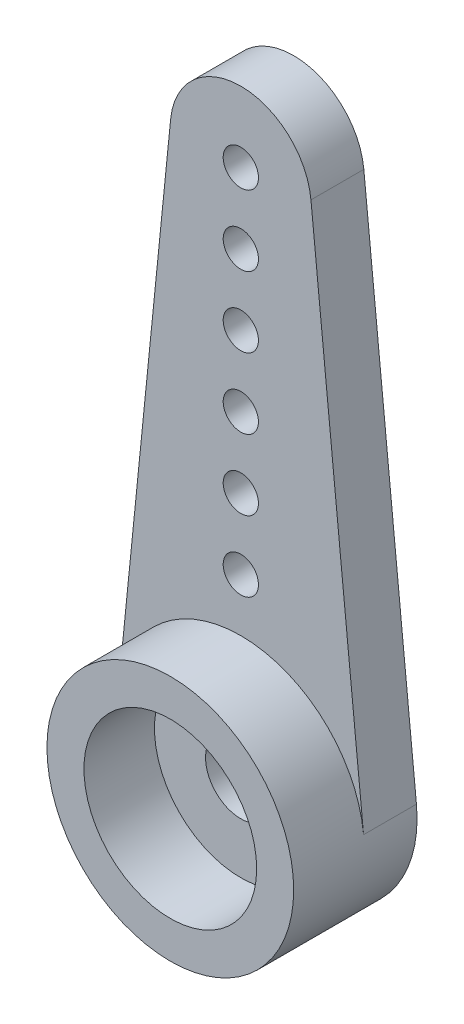
ISO-10303-21;
HEADER;
FILE_DESCRIPTION(('STEP AP214'),'2;1');
FILE_NAME('part.step','',(''),(''),'','','');
FILE_SCHEMA(('AUTOMOTIVE_DESIGN { 1 0 10303 214 1 1 1 1 }'));
ENDSEC;
DATA;
#1=APPLICATION_CONTEXT('core data for automotive mechanical design processes');
#2=APPLICATION_PROTOCOL_DEFINITION('international standard','automotive_design',2000,#1);
#3=PRODUCT_CONTEXT('',#1,'mechanical');
#4=PRODUCT('Part','Part','',(#3));
#5=PRODUCT_RELATED_PRODUCT_CATEGORY('part','',(#4));
#6=PRODUCT_DEFINITION_FORMATION('','',#4);
#7=PRODUCT_DEFINITION_CONTEXT('part definition',#1,'design');
#8=PRODUCT_DEFINITION('design','',#6,#7);
#9=PRODUCT_DEFINITION_SHAPE('','',#8);
#10=(LENGTH_UNIT() NAMED_UNIT(*) SI_UNIT(.MILLI.,.METRE.));
#11=(NAMED_UNIT(*) PLANE_ANGLE_UNIT() SI_UNIT($,.RADIAN.));
#12=(NAMED_UNIT(*) SI_UNIT($,.STERADIAN.) SOLID_ANGLE_UNIT());
#13=UNCERTAINTY_MEASURE_WITH_UNIT(LENGTH_MEASURE(1.E-05),#10,'distance_accuracy_value','');
#14=(GEOMETRIC_REPRESENTATION_CONTEXT(3) GLOBAL_UNCERTAINTY_ASSIGNED_CONTEXT((#13)) GLOBAL_UNIT_ASSIGNED_CONTEXT((#10,
#11,#12)) REPRESENTATION_CONTEXT('',''));
#15=CARTESIAN_POINT('',(0.,0.,0.));
#16=DIRECTION('',(0.,0.,1.));
#17=DIRECTION('',(1.,0.,0.));
#18=AXIS2_PLACEMENT_3D('',#15,#16,#17);
#19=CARTESIAN_POINT('',(0.,0.,1.5));
#20=DIRECTION('',(0.,0.,-1.));
#21=DIRECTION('',(-1.,0.,0.));
#22=AXIS2_PLACEMENT_3D('',#19,#20,#21);
#23=CYLINDRICAL_SURFACE('',#22,1.);
#24=CARTESIAN_POINT('',(0.,0.,0.));
#25=DIRECTION('',(0.,0.,1.));
#26=DIRECTION('',(1.,0.,0.));
#27=AXIS2_PLACEMENT_3D('',#24,#25,#26);
#28=CIRCLE('',#27,1.);
#29=CARTESIAN_POINT('',(1.,0.,0.));
#30=VERTEX_POINT('',#29);
#31=EDGE_CURVE('E135',#30,#30,#28,.T.);
#32=ORIENTED_EDGE('',*,*,#31,.F.);
#33=EDGE_LOOP('',(#32));
#34=FACE_BOUND('',#33,.T.);
#35=CARTESIAN_POINT('',(0.,0.,1.5));
#36=DIRECTION('',(0.,0.,1.));
#37=DIRECTION('',(1.,0.,0.));
#38=AXIS2_PLACEMENT_3D('',#35,#36,#37);
#39=CIRCLE('',#38,1.);
#40=CARTESIAN_POINT('',(1.,0.,1.5));
#41=VERTEX_POINT('',#40);
#42=EDGE_CURVE('E36',#41,#41,#39,.T.);
#43=ORIENTED_EDGE('',*,*,#42,.T.);
#44=EDGE_LOOP('',(#43));
#45=FACE_BOUND('',#44,.T.);
#46=ADVANCED_FACE('F32',(#34,#45),#23,.F.);
#47=CARTESIAN_POINT('',(0.,15.,1.5));
#48=DIRECTION('',(0.,0.,1.));
#49=DIRECTION('',(1.,0.,0.));
#50=AXIS2_PLACEMENT_3D('',#47,#48,#49);
#51=PLANE('',#50);
#52=CARTESIAN_POINT('',(0.,0.,1.5));
#53=DIRECTION('',(0.,0.,1.));
#54=DIRECTION('',(1.,0.,0.));
#55=AXIS2_PLACEMENT_3D('',#52,#53,#54);
#56=CIRCLE('',#55,3.5);
#57=CARTESIAN_POINT('',(3.48245602987317,0.35,1.5));
#58=VERTEX_POINT('',#57);
#59=CARTESIAN_POINT('',(-3.48245602987317,0.35,1.5));
#60=VERTEX_POINT('',#59);
#61=EDGE_CURVE('E89',#58,#60,#56,.T.);
#62=ORIENTED_EDGE('',*,*,#61,.F.);
#63=DIRECTION('',(-0.1,0.99498743710662,0.));
#64=VECTOR('',#63,1.);
#65=CARTESIAN_POINT('',(1.98997487421324,15.2,1.5));
#66=LINE('',#65,#64);
#67=CARTESIAN_POINT('',(1.98997487421324,15.2,1.5));
#68=VERTEX_POINT('',#67);
#69=EDGE_CURVE('E50',#58,#68,#66,.T.);
#70=ORIENTED_EDGE('',*,*,#69,.T.);
#71=CARTESIAN_POINT('',(0.,15.,1.5));
#72=DIRECTION('',(0.,0.,1.));
#73=DIRECTION('',(1.,0.,0.));
#74=AXIS2_PLACEMENT_3D('',#71,#72,#73);
#75=CIRCLE('',#74,2.);
#76=CARTESIAN_POINT('',(-1.98997487421324,15.2,1.5));
#77=VERTEX_POINT('',#76);
#78=EDGE_CURVE('E141',#68,#77,#75,.T.);
#79=ORIENTED_EDGE('',*,*,#78,.T.);
#80=DIRECTION('',(-0.1,-0.99498743710662,0.));
#81=VECTOR('',#80,1.);
#82=CARTESIAN_POINT('',(-1.98997487421324,15.2,1.5));
#83=LINE('',#82,#81);
#84=EDGE_CURVE('E79',#77,#60,#83,.T.);
#85=ORIENTED_EDGE('',*,*,#84,.T.);
#86=EDGE_LOOP('',(#62,#70,#79,#85));
#87=FACE_BOUND('',#86,.T.);
#88=CARTESIAN_POINT('',(0.,7.,1.5));
#89=DIRECTION('',(0.,0.,1.));
#90=DIRECTION('',(1.,0.,0.));
#91=AXIS2_PLACEMENT_3D('',#88,#89,#90);
#92=CIRCLE('',#91,0.5);
#93=CARTESIAN_POINT('',(0.500000000000084,7.,1.5));
#94=VERTEX_POINT('',#93);
#95=EDGE_CURVE('E108',#94,#94,#92,.T.);
#96=ORIENTED_EDGE('',*,*,#95,.F.);
#97=EDGE_LOOP('',(#96));
#98=FACE_BOUND('',#97,.T.);
#99=CARTESIAN_POINT('',(0.,11.,1.5));
#100=DIRECTION('',(0.,0.,1.));
#101=DIRECTION('',(1.,0.,0.));
#102=AXIS2_PLACEMENT_3D('',#99,#100,#101);
#103=CIRCLE('',#102,0.5);
#104=CARTESIAN_POINT('',(0.500000000000042,11.,1.5));
#105=VERTEX_POINT('',#104);
#106=EDGE_CURVE('E120',#105,#105,#103,.T.);
#107=ORIENTED_EDGE('',*,*,#106,.F.);
#108=EDGE_LOOP('',(#107));
#109=FACE_BOUND('',#108,.T.);
#110=CARTESIAN_POINT('',(0.,15.,1.5));
#111=DIRECTION('',(0.,0.,1.));
#112=DIRECTION('',(1.,0.,0.));
#113=AXIS2_PLACEMENT_3D('',#110,#111,#112);
#114=CIRCLE('',#113,0.5);
#115=CARTESIAN_POINT('',(0.5,15.,1.5));
#116=VERTEX_POINT('',#115);
#117=EDGE_CURVE('E132',#116,#116,#114,.T.);
#118=ORIENTED_EDGE('',*,*,#117,.F.);
#119=EDGE_LOOP('',(#118));
#120=FACE_BOUND('',#119,.T.);
#121=CARTESIAN_POINT('',(0.,13.,1.5));
#122=DIRECTION('',(0.,0.,1.));
#123=DIRECTION('',(1.,0.,0.));
#124=AXIS2_PLACEMENT_3D('',#121,#122,#123);
#125=CIRCLE('',#124,0.5);
#126=CARTESIAN_POINT('',(0.500000000000021,13.,1.5));
#127=VERTEX_POINT('',#126);
#128=EDGE_CURVE('E126',#127,#127,#125,.T.);
#129=ORIENTED_EDGE('',*,*,#128,.F.);
#130=EDGE_LOOP('',(#129));
#131=FACE_BOUND('',#130,.T.);
#132=CARTESIAN_POINT('',(0.,9.,1.5));
#133=DIRECTION('',(0.,0.,1.));
#134=DIRECTION('',(1.,0.,0.));
#135=AXIS2_PLACEMENT_3D('',#132,#133,#134);
#136=CIRCLE('',#135,0.5);
#137=CARTESIAN_POINT('',(0.500000000000063,9.,1.5));
#138=VERTEX_POINT('',#137);
#139=EDGE_CURVE('E114',#138,#138,#136,.T.);
#140=ORIENTED_EDGE('',*,*,#139,.F.);
#141=EDGE_LOOP('',(#140));
#142=FACE_BOUND('',#141,.T.);
#143=CARTESIAN_POINT('',(1.04744440165294E-13,5.,1.5));
#144=DIRECTION('',(0.,0.,1.));
#145=DIRECTION('',(1.,0.,0.));
#146=AXIS2_PLACEMENT_3D('',#143,#144,#145);
#147=CIRCLE('',#146,0.5);
#148=CARTESIAN_POINT('',(0.500000000000105,5.,1.5));
#149=VERTEX_POINT('',#148);
#150=EDGE_CURVE('E102',#149,#149,#147,.T.);
#151=ORIENTED_EDGE('',*,*,#150,.F.);
#152=EDGE_LOOP('',(#151));
#153=FACE_BOUND('',#152,.T.);
#154=ADVANCED_FACE('F91',(#87,#98,#109,#120,#131,#142,#153),#51,.T.);
#155=CARTESIAN_POINT('',(0.,15.,0.));
#156=DIRECTION('',(0.,0.,1.));
#157=DIRECTION('',(1.,0.,0.));
#158=AXIS2_PLACEMENT_3D('',#155,#156,#157);
#159=PLANE('',#158);
#160=CARTESIAN_POINT('',(0.,15.,0.));
#161=DIRECTION('',(0.,0.,1.));
#162=DIRECTION('',(1.,0.,0.));
#163=AXIS2_PLACEMENT_3D('',#160,#161,#162);
#164=CIRCLE('',#163,2.);
#165=CARTESIAN_POINT('',(1.98997487421324,15.2,0.));
#166=VERTEX_POINT('',#165);
#167=CARTESIAN_POINT('',(-1.98997487421324,15.2,0.));
#168=VERTEX_POINT('',#167);
#169=EDGE_CURVE('E140',#166,#168,#164,.T.);
#170=ORIENTED_EDGE('',*,*,#169,.F.);
#171=DIRECTION('',(-0.1,0.99498743710662,0.));
#172=VECTOR('',#171,1.);
#173=CARTESIAN_POINT('',(1.98997487421324,15.2,0.));
#174=LINE('',#173,#172);
#175=CARTESIAN_POINT('',(3.48245602987317,0.35,0.));
#176=VERTEX_POINT('',#175);
#177=EDGE_CURVE('E74',#176,#166,#174,.T.);
#178=ORIENTED_EDGE('',*,*,#177,.F.);
#179=CARTESIAN_POINT('',(0.,0.,0.));
#180=DIRECTION('',(0.,0.,1.));
#181=DIRECTION('',(1.,0.,0.));
#182=AXIS2_PLACEMENT_3D('',#179,#180,#181);
#183=CIRCLE('',#182,3.5);
#184=CARTESIAN_POINT('',(-3.48245602987317,0.35,0.));
#185=VERTEX_POINT('',#184);
#186=EDGE_CURVE('E69',#185,#176,#183,.T.);
#187=ORIENTED_EDGE('',*,*,#186,.F.);
#188=DIRECTION('',(-0.1,-0.99498743710662,0.));
#189=VECTOR('',#188,1.);
#190=CARTESIAN_POINT('',(-1.98997487421324,15.2,0.));
#191=LINE('',#190,#189);
#192=EDGE_CURVE('E146',#168,#185,#191,.T.);
#193=ORIENTED_EDGE('',*,*,#192,.F.);
#194=EDGE_LOOP('',(#170,#178,#187,#193));
#195=FACE_BOUND('',#194,.T.);
#196=ORIENTED_EDGE('',*,*,#31,.T.);
#197=EDGE_LOOP('',(#196));
#198=FACE_BOUND('',#197,.T.);
#199=CARTESIAN_POINT('',(0.,15.,0.));
#200=DIRECTION('',(0.,0.,1.));
#201=DIRECTION('',(1.,0.,0.));
#202=AXIS2_PLACEMENT_3D('',#199,#200,#201);
#203=CIRCLE('',#202,0.5);
#204=CARTESIAN_POINT('',(0.5,15.,0.));
#205=VERTEX_POINT('',#204);
#206=EDGE_CURVE('E129',#205,#205,#203,.T.);
#207=ORIENTED_EDGE('',*,*,#206,.T.);
#208=EDGE_LOOP('',(#207));
#209=FACE_BOUND('',#208,.T.);
#210=CARTESIAN_POINT('',(0.,13.,0.));
#211=DIRECTION('',(0.,0.,1.));
#212=DIRECTION('',(1.,0.,0.));
#213=AXIS2_PLACEMENT_3D('',#210,#211,#212);
#214=CIRCLE('',#213,0.5);
#215=CARTESIAN_POINT('',(0.500000000000021,13.,0.));
#216=VERTEX_POINT('',#215);
#217=EDGE_CURVE('E123',#216,#216,#214,.T.);
#218=ORIENTED_EDGE('',*,*,#217,.T.);
#219=EDGE_LOOP('',(#218));
#220=FACE_BOUND('',#219,.T.);
#221=CARTESIAN_POINT('',(0.,11.,0.));
#222=DIRECTION('',(0.,0.,1.));
#223=DIRECTION('',(1.,0.,0.));
#224=AXIS2_PLACEMENT_3D('',#221,#222,#223);
#225=CIRCLE('',#224,0.5);
#226=CARTESIAN_POINT('',(0.500000000000042,11.,0.));
#227=VERTEX_POINT('',#226);
#228=EDGE_CURVE('E117',#227,#227,#225,.T.);
#229=ORIENTED_EDGE('',*,*,#228,.T.);
#230=EDGE_LOOP('',(#229));
#231=FACE_BOUND('',#230,.T.);
#232=CARTESIAN_POINT('',(0.,9.,0.));
#233=DIRECTION('',(0.,0.,1.));
#234=DIRECTION('',(1.,0.,0.));
#235=AXIS2_PLACEMENT_3D('',#232,#233,#234);
#236=CIRCLE('',#235,0.5);
#237=CARTESIAN_POINT('',(0.500000000000063,9.,0.));
#238=VERTEX_POINT('',#237);
#239=EDGE_CURVE('E111',#238,#238,#236,.T.);
#240=ORIENTED_EDGE('',*,*,#239,.T.);
#241=EDGE_LOOP('',(#240));
#242=FACE_BOUND('',#241,.T.);
#243=CARTESIAN_POINT('',(0.,7.,0.));
#244=DIRECTION('',(0.,0.,1.));
#245=DIRECTION('',(1.,0.,0.));
#246=AXIS2_PLACEMENT_3D('',#243,#244,#245);
#247=CIRCLE('',#246,0.5);
#248=CARTESIAN_POINT('',(0.500000000000084,7.,0.));
#249=VERTEX_POINT('',#248);
#250=EDGE_CURVE('E105',#249,#249,#247,.T.);
#251=ORIENTED_EDGE('',*,*,#250,.T.);
#252=EDGE_LOOP('',(#251));
#253=FACE_BOUND('',#252,.T.);
#254=CARTESIAN_POINT('',(1.04744440165294E-13,5.,0.));
#255=DIRECTION('',(0.,0.,1.));
#256=DIRECTION('',(1.,0.,0.));
#257=AXIS2_PLACEMENT_3D('',#254,#255,#256);
#258=CIRCLE('',#257,0.5);
#259=CARTESIAN_POINT('',(0.500000000000105,5.,0.));
#260=VERTEX_POINT('',#259);
#261=EDGE_CURVE('E96',#260,#260,#258,.T.);
#262=ORIENTED_EDGE('',*,*,#261,.T.);
#263=EDGE_LOOP('',(#262));
#264=FACE_BOUND('',#263,.T.);
#265=ADVANCED_FACE('F153',(#195,#198,#209,#220,#231,#242,#253,#264),#159,.F.);
#266=CARTESIAN_POINT('',(0.,15.,1.5));
#267=DIRECTION('',(0.,0.,-1.));
#268=DIRECTION('',(-1.,0.,0.));
#269=AXIS2_PLACEMENT_3D('',#266,#267,#268);
#270=CYLINDRICAL_SURFACE('',#269,2.);
#271=ORIENTED_EDGE('',*,*,#169,.T.);
#272=DIRECTION('',(0.,0.,-1.));
#273=VECTOR('',#272,1.);
#274=CARTESIAN_POINT('',(-1.98997487421324,15.2,1.5));
#275=LINE('',#274,#273);
#276=EDGE_CURVE('E11',#77,#168,#275,.T.);
#277=ORIENTED_EDGE('',*,*,#276,.F.);
#278=ORIENTED_EDGE('',*,*,#78,.F.);
#279=DIRECTION('',(0.,0.,-1.));
#280=VECTOR('',#279,1.);
#281=CARTESIAN_POINT('',(1.98997487421324,15.2,1.5));
#282=LINE('',#281,#280);
#283=EDGE_CURVE('E83',#68,#166,#282,.T.);
#284=ORIENTED_EDGE('',*,*,#283,.T.);
#285=EDGE_LOOP('',(#271,#277,#278,#284));
#286=FACE_BOUND('',#285,.T.);
#287=ADVANCED_FACE('F34',(#286),#270,.T.);
#288=CARTESIAN_POINT('',(-1.98997487421324,15.2,1.5));
#289=DIRECTION('',(0.99498743710662,-0.1,0.));
#290=DIRECTION('',(0.1,0.99498743710662,0.));
#291=AXIS2_PLACEMENT_3D('',#288,#289,#290);
#292=PLANE('',#291);
#293=ORIENTED_EDGE('',*,*,#192,.T.);
#294=DIRECTION('',(0.,0.,-1.));
#295=VECTOR('',#294,1.);
#296=CARTESIAN_POINT('',(-3.48245602987317,0.35,1.5));
#297=LINE('',#296,#295);
#298=EDGE_CURVE('E42',#60,#185,#297,.T.);
#299=ORIENTED_EDGE('',*,*,#298,.F.);
#300=ORIENTED_EDGE('',*,*,#84,.F.);
#301=ORIENTED_EDGE('',*,*,#276,.T.);
#302=EDGE_LOOP('',(#293,#299,#300,#301));
#303=FACE_BOUND('',#302,.T.);
#304=ADVANCED_FACE('F157',(#303),#292,.F.);
#305=CARTESIAN_POINT('',(0.,0.,1.5));
#306=DIRECTION('',(0.,0.,-1.));
#307=DIRECTION('',(-1.,0.,0.));
#308=AXIS2_PLACEMENT_3D('',#305,#306,#307);
#309=CYLINDRICAL_SURFACE('',#308,3.5);
#310=ORIENTED_EDGE('',*,*,#186,.T.);
#311=DIRECTION('',(0.,0.,-1.));
#312=VECTOR('',#311,1.);
#313=CARTESIAN_POINT('',(3.48245602987317,0.35,1.5));
#314=LINE('',#313,#312);
#315=EDGE_CURVE('E82',#58,#176,#314,.T.);
#316=ORIENTED_EDGE('',*,*,#315,.F.);
#317=ORIENTED_EDGE('',*,*,#61,.T.);
#318=ORIENTED_EDGE('',*,*,#298,.T.);
#319=EDGE_LOOP('',(#310,#316,#317,#318));
#320=FACE_BOUND('',#319,.T.);
#321=CARTESIAN_POINT('',(0.,0.,3.5));
#322=DIRECTION('',(0.,0.,1.));
#323=DIRECTION('',(1.,0.,0.));
#324=AXIS2_PLACEMENT_3D('',#321,#322,#323);
#325=CIRCLE('',#324,3.5);
#326=CARTESIAN_POINT('',(3.5,0.,3.5));
#327=VERTEX_POINT('',#326);
#328=EDGE_CURVE('E93',#327,#327,#325,.T.);
#329=ORIENTED_EDGE('',*,*,#328,.F.);
#330=EDGE_LOOP('',(#329));
#331=FACE_BOUND('',#330,.T.);
#332=ADVANCED_FACE('F87',(#320,#331),#309,.T.);
#333=CARTESIAN_POINT('',(1.98997487421324,15.2,1.5));
#334=DIRECTION('',(-0.99498743710662,-0.1,0.));
#335=DIRECTION('',(0.1,-0.99498743710662,0.));
#336=AXIS2_PLACEMENT_3D('',#333,#334,#335);
#337=PLANE('',#336);
#338=ORIENTED_EDGE('',*,*,#177,.T.);
#339=ORIENTED_EDGE('',*,*,#283,.F.);
#340=ORIENTED_EDGE('',*,*,#69,.F.);
#341=ORIENTED_EDGE('',*,*,#315,.T.);
#342=EDGE_LOOP('',(#338,#339,#340,#341));
#343=FACE_BOUND('',#342,.T.);
#344=ADVANCED_FACE('F81',(#343),#337,.F.);
#345=CARTESIAN_POINT('',(0.,15.,1.5));
#346=DIRECTION('',(0.,0.,-1.));
#347=DIRECTION('',(-1.,0.,0.));
#348=AXIS2_PLACEMENT_3D('',#345,#346,#347);
#349=CYLINDRICAL_SURFACE('',#348,0.5);
#350=ORIENTED_EDGE('',*,*,#117,.T.);
#351=EDGE_LOOP('',(#350));
#352=FACE_BOUND('',#351,.T.);
#353=ORIENTED_EDGE('',*,*,#206,.F.);
#354=EDGE_LOOP('',(#353));
#355=FACE_BOUND('',#354,.T.);
#356=ADVANCED_FACE('F174',(#352,#355),#349,.F.);
#357=CARTESIAN_POINT('',(0.,13.,1.5));
#358=DIRECTION('',(0.,0.,-1.));
#359=DIRECTION('',(-1.,0.,0.));
#360=AXIS2_PLACEMENT_3D('',#357,#358,#359);
#361=CYLINDRICAL_SURFACE('',#360,0.5);
#362=ORIENTED_EDGE('',*,*,#128,.T.);
#363=EDGE_LOOP('',(#362));
#364=FACE_BOUND('',#363,.T.);
#365=ORIENTED_EDGE('',*,*,#217,.F.);
#366=EDGE_LOOP('',(#365));
#367=FACE_BOUND('',#366,.T.);
#368=ADVANCED_FACE('F183',(#364,#367),#361,.F.);
#369=CARTESIAN_POINT('',(0.,11.,1.5));
#370=DIRECTION('',(0.,0.,-1.));
#371=DIRECTION('',(-1.,0.,0.));
#372=AXIS2_PLACEMENT_3D('',#369,#370,#371);
#373=CYLINDRICAL_SURFACE('',#372,0.5);
#374=ORIENTED_EDGE('',*,*,#106,.T.);
#375=EDGE_LOOP('',(#374));
#376=FACE_BOUND('',#375,.T.);
#377=ORIENTED_EDGE('',*,*,#228,.F.);
#378=EDGE_LOOP('',(#377));
#379=FACE_BOUND('',#378,.T.);
#380=ADVANCED_FACE('F188',(#376,#379),#373,.F.);
#381=CARTESIAN_POINT('',(0.,9.,1.5));
#382=DIRECTION('',(0.,0.,-1.));
#383=DIRECTION('',(-1.,0.,0.));
#384=AXIS2_PLACEMENT_3D('',#381,#382,#383);
#385=CYLINDRICAL_SURFACE('',#384,0.5);
#386=ORIENTED_EDGE('',*,*,#139,.T.);
#387=EDGE_LOOP('',(#386));
#388=FACE_BOUND('',#387,.T.);
#389=ORIENTED_EDGE('',*,*,#239,.F.);
#390=EDGE_LOOP('',(#389));
#391=FACE_BOUND('',#390,.T.);
#392=ADVANCED_FACE('F218',(#388,#391),#385,.F.);
#393=CARTESIAN_POINT('',(0.,7.,1.5));
#394=DIRECTION('',(0.,0.,-1.));
#395=DIRECTION('',(-1.,0.,0.));
#396=AXIS2_PLACEMENT_3D('',#393,#394,#395);
#397=CYLINDRICAL_SURFACE('',#396,0.5);
#398=ORIENTED_EDGE('',*,*,#95,.T.);
#399=EDGE_LOOP('',(#398));
#400=FACE_BOUND('',#399,.T.);
#401=ORIENTED_EDGE('',*,*,#250,.F.);
#402=EDGE_LOOP('',(#401));
#403=FACE_BOUND('',#402,.T.);
#404=ADVANCED_FACE('F208',(#400,#403),#397,.F.);
#405=CARTESIAN_POINT('',(1.04744440165294E-13,5.,1.5));
#406=DIRECTION('',(0.,0.,-1.));
#407=DIRECTION('',(-1.,0.,0.));
#408=AXIS2_PLACEMENT_3D('',#405,#406,#407);
#409=CYLINDRICAL_SURFACE('',#408,0.5);
#410=ORIENTED_EDGE('',*,*,#150,.T.);
#411=EDGE_LOOP('',(#410));
#412=FACE_BOUND('',#411,.T.);
#413=ORIENTED_EDGE('',*,*,#261,.F.);
#414=EDGE_LOOP('',(#413));
#415=FACE_BOUND('',#414,.T.);
#416=ADVANCED_FACE('F205',(#412,#415),#409,.F.);
#417=CARTESIAN_POINT('',(0.,0.,3.5));
#418=DIRECTION('',(0.,0.,1.));
#419=DIRECTION('',(1.,0.,0.));
#420=AXIS2_PLACEMENT_3D('',#417,#418,#419);
#421=PLANE('',#420);
#422=CARTESIAN_POINT('',(0.,0.,3.5));
#423=DIRECTION('',(0.,0.,1.));
#424=DIRECTION('',(1.,0.,0.));
#425=AXIS2_PLACEMENT_3D('',#422,#423,#424);
#426=CIRCLE('',#425,2.45);
#427=CARTESIAN_POINT('',(2.45,0.,3.5));
#428=VERTEX_POINT('',#427);
#429=EDGE_CURVE('E312',#428,#428,#426,.T.);
#430=ORIENTED_EDGE('',*,*,#429,.F.);
#431=EDGE_LOOP('',(#430));
#432=FACE_BOUND('',#431,.T.);
#433=ORIENTED_EDGE('',*,*,#328,.T.);
#434=EDGE_LOOP('',(#433));
#435=FACE_BOUND('',#434,.T.);
#436=ADVANCED_FACE('F207',(#432,#435),#421,.T.);
#437=CARTESIAN_POINT('',(0.,0.,1.5));
#438=DIRECTION('',(0.,0.,1.));
#439=DIRECTION('',(1.,0.,0.));
#440=AXIS2_PLACEMENT_3D('',#437,#438,#439);
#441=CYLINDRICAL_SURFACE('',#440,2.45);
#442=CARTESIAN_POINT('',(0.,0.,1.5));
#443=DIRECTION('',(0.,0.,1.));
#444=DIRECTION('',(1.,0.,0.));
#445=AXIS2_PLACEMENT_3D('',#442,#443,#444);
#446=CIRCLE('',#445,2.45);
#447=CARTESIAN_POINT('',(2.45,0.,1.5));
#448=VERTEX_POINT('',#447);
#449=EDGE_CURVE('E99',#448,#448,#446,.T.);
#450=ORIENTED_EDGE('',*,*,#449,.F.);
#451=EDGE_LOOP('',(#450));
#452=FACE_BOUND('',#451,.T.);
#453=ORIENTED_EDGE('',*,*,#429,.T.);
#454=EDGE_LOOP('',(#453));
#455=FACE_BOUND('',#454,.T.);
#456=ADVANCED_FACE('F215',(#452,#455),#441,.F.);
#457=CARTESIAN_POINT('',(0.,0.,1.5));
#458=DIRECTION('',(0.,0.,1.));
#459=DIRECTION('',(1.,0.,0.));
#460=AXIS2_PLACEMENT_3D('',#457,#458,#459);
#461=PLANE('',#460);
#462=ORIENTED_EDGE('',*,*,#42,.F.);
#463=EDGE_LOOP('',(#462));
#464=FACE_BOUND('',#463,.T.);
#465=ORIENTED_EDGE('',*,*,#449,.T.);
#466=EDGE_LOOP('',(#465));
#467=FACE_BOUND('',#466,.T.);
#468=ADVANCED_FACE('F295',(#464,#467),#461,.T.);
#469=CLOSED_SHELL('',(#46,#154,#265,#287,#304,#332,#344,#356,#368,#380,#392,#404,#416,#436,#456,#468));
#470=MANIFOLD_SOLID_BREP('B2',#469);
#471=ADVANCED_BREP_SHAPE_REPRESENTATION('',(#18,#470),#14);
#472=SHAPE_DEFINITION_REPRESENTATION(#9,#471);
ENDSEC;
END-ISO-10303-21;
